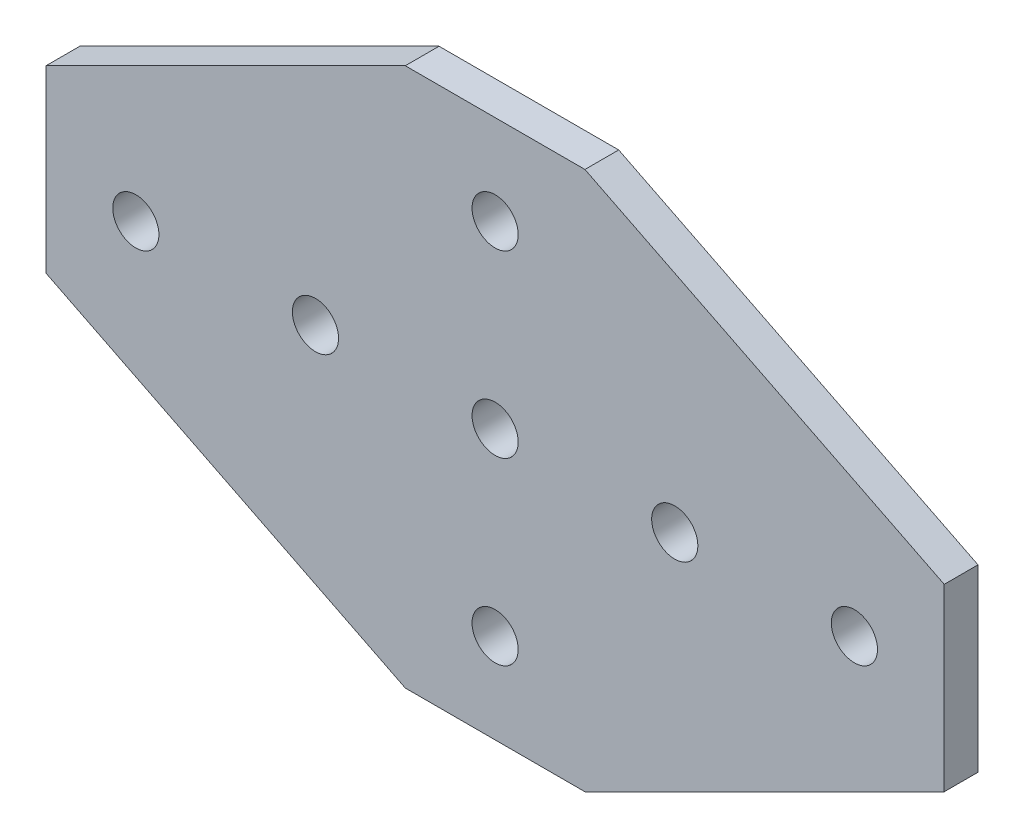
ISO-10303-21;
HEADER;
FILE_DESCRIPTION(('STEP AP214'),'2;1');
FILE_NAME('part.step','',(''),(''),'','','');
FILE_SCHEMA(('AUTOMOTIVE_DESIGN { 1 0 10303 214 1 1 1 1 }'));
ENDSEC;
DATA;
#1=APPLICATION_CONTEXT('core data for automotive mechanical design processes');
#2=APPLICATION_PROTOCOL_DEFINITION('international standard','automotive_design',2000,#1);
#3=PRODUCT_CONTEXT('',#1,'mechanical');
#4=PRODUCT('Part','Part','',(#3));
#5=PRODUCT_RELATED_PRODUCT_CATEGORY('part','',(#4));
#6=PRODUCT_DEFINITION_FORMATION('','',#4);
#7=PRODUCT_DEFINITION_CONTEXT('part definition',#1,'design');
#8=PRODUCT_DEFINITION('design','',#6,#7);
#9=PRODUCT_DEFINITION_SHAPE('','',#8);
#10=(LENGTH_UNIT() NAMED_UNIT(*) SI_UNIT(.MILLI.,.METRE.));
#11=(NAMED_UNIT(*) PLANE_ANGLE_UNIT() SI_UNIT($,.RADIAN.));
#12=(NAMED_UNIT(*) SI_UNIT($,.STERADIAN.) SOLID_ANGLE_UNIT());
#13=UNCERTAINTY_MEASURE_WITH_UNIT(LENGTH_MEASURE(1.E-05),#10,'distance_accuracy_value','');
#14=(GEOMETRIC_REPRESENTATION_CONTEXT(3) GLOBAL_UNCERTAINTY_ASSIGNED_CONTEXT((#13)) GLOBAL_UNIT_ASSIGNED_CONTEXT((#10,
#11,#12)) REPRESENTATION_CONTEXT('',''));
#15=CARTESIAN_POINT('',(0.,0.,0.));
#16=DIRECTION('',(0.,0.,1.));
#17=DIRECTION('',(1.,0.,0.));
#18=AXIS2_PLACEMENT_3D('',#15,#16,#17);
#19=CARTESIAN_POINT('',(0.,25.4,4.7752));
#20=DIRECTION('',(0.447213595499958,0.894427190999916,0.));
#21=DIRECTION('',(-0.894427190999916,0.447213595499958,0.));
#22=AXIS2_PLACEMENT_3D('',#19,#20,#21);
#23=PLANE('',#22);
#24=DIRECTION('',(0.894427190999916,-0.447213595499958,0.));
#25=VECTOR('',#24,1.);
#26=CARTESIAN_POINT('',(0.,25.4,0.));
#27=LINE('',#26,#25);
#28=CARTESIAN_POINT('',(0.,25.4,0.));
#29=VERTEX_POINT('',#28);
#30=CARTESIAN_POINT('',(50.8,0.,0.));
#31=VERTEX_POINT('',#30);
#32=EDGE_CURVE('E132',#29,#31,#27,.T.);
#33=ORIENTED_EDGE('',*,*,#32,.T.);
#34=DIRECTION('',(0.,0.,-1.));
#35=VECTOR('',#34,1.);
#36=CARTESIAN_POINT('',(50.8,0.,4.7752));
#37=LINE('',#36,#35);
#38=CARTESIAN_POINT('',(50.8,0.,4.7752));
#39=VERTEX_POINT('',#38);
#40=EDGE_CURVE('E160',#39,#31,#37,.T.);
#41=ORIENTED_EDGE('',*,*,#40,.F.);
#42=DIRECTION('',(0.894427190999916,-0.447213595499958,0.));
#43=VECTOR('',#42,1.);
#44=CARTESIAN_POINT('',(0.,25.4,4.7752));
#45=LINE('',#44,#43);
#46=CARTESIAN_POINT('',(0.,25.4,4.7752));
#47=VERTEX_POINT('',#46);
#48=EDGE_CURVE('E147',#47,#39,#45,.T.);
#49=ORIENTED_EDGE('',*,*,#48,.F.);
#50=DIRECTION('',(0.,0.,-1.));
#51=VECTOR('',#50,1.);
#52=CARTESIAN_POINT('',(0.,25.4,4.7752));
#53=LINE('',#52,#51);
#54=EDGE_CURVE('E128',#47,#29,#53,.T.);
#55=ORIENTED_EDGE('',*,*,#54,.T.);
#56=EDGE_LOOP('',(#33,#41,#49,#55));
#57=FACE_BOUND('',#56,.T.);
#58=ADVANCED_FACE('F33',(#57),#23,.F.);
#59=CARTESIAN_POINT('',(50.8,0.,4.7752));
#60=DIRECTION('',(0.,1.,0.));
#61=DIRECTION('',(-1.,0.,0.));
#62=AXIS2_PLACEMENT_3D('',#59,#60,#61);
#63=PLANE('',#62);
#64=DIRECTION('',(1.,0.,0.));
#65=VECTOR('',#64,1.);
#66=CARTESIAN_POINT('',(50.8,0.,0.));
#67=LINE('',#66,#65);
#68=CARTESIAN_POINT('',(76.2,0.,0.));
#69=VERTEX_POINT('',#68);
#70=EDGE_CURVE('E135',#31,#69,#67,.T.);
#71=ORIENTED_EDGE('',*,*,#70,.T.);
#72=DIRECTION('',(0.,0.,-1.));
#73=VECTOR('',#72,1.);
#74=CARTESIAN_POINT('',(76.2,0.,4.7752));
#75=LINE('',#74,#73);
#76=CARTESIAN_POINT('',(76.2,0.,4.7752));
#77=VERTEX_POINT('',#76);
#78=EDGE_CURVE('E157',#77,#69,#75,.T.);
#79=ORIENTED_EDGE('',*,*,#78,.F.);
#80=DIRECTION('',(1.,0.,0.));
#81=VECTOR('',#80,1.);
#82=CARTESIAN_POINT('',(50.8,0.,4.7752));
#83=LINE('',#82,#81);
#84=EDGE_CURVE('E94',#39,#77,#83,.T.);
#85=ORIENTED_EDGE('',*,*,#84,.F.);
#86=ORIENTED_EDGE('',*,*,#40,.T.);
#87=EDGE_LOOP('',(#71,#79,#85,#86));
#88=FACE_BOUND('',#87,.T.);
#89=ADVANCED_FACE('F200',(#88),#63,.F.);
#90=CARTESIAN_POINT('',(76.2,0.,4.7752));
#91=DIRECTION('',(-0.447213595499958,0.894427190999916,0.));
#92=DIRECTION('',(-0.894427190999916,-0.447213595499958,0.));
#93=AXIS2_PLACEMENT_3D('',#90,#91,#92);
#94=PLANE('',#93);
#95=DIRECTION('',(0.894427190999916,0.447213595499958,0.));
#96=VECTOR('',#95,1.);
#97=CARTESIAN_POINT('',(76.2,0.,0.));
#98=LINE('',#97,#96);
#99=CARTESIAN_POINT('',(127.,25.4,0.));
#100=VERTEX_POINT('',#99);
#101=EDGE_CURVE('E138',#69,#100,#98,.T.);
#102=ORIENTED_EDGE('',*,*,#101,.T.);
#103=DIRECTION('',(0.,0.,-1.));
#104=VECTOR('',#103,1.);
#105=CARTESIAN_POINT('',(127.,25.4,4.7752));
#106=LINE('',#105,#104);
#107=CARTESIAN_POINT('',(127.,25.4,4.7752));
#108=VERTEX_POINT('',#107);
#109=EDGE_CURVE('E154',#108,#100,#106,.T.);
#110=ORIENTED_EDGE('',*,*,#109,.F.);
#111=DIRECTION('',(0.894427190999916,0.447213595499958,0.));
#112=VECTOR('',#111,1.);
#113=CARTESIAN_POINT('',(76.2,0.,4.7752));
#114=LINE('',#113,#112);
#115=EDGE_CURVE('E333',#77,#108,#114,.T.);
#116=ORIENTED_EDGE('',*,*,#115,.F.);
#117=ORIENTED_EDGE('',*,*,#78,.T.);
#118=EDGE_LOOP('',(#102,#110,#116,#117));
#119=FACE_BOUND('',#118,.T.);
#120=ADVANCED_FACE('F206',(#119),#94,.F.);
#121=CARTESIAN_POINT('',(127.,25.4,4.7752));
#122=DIRECTION('',(-1.,0.,0.));
#123=DIRECTION('',(0.,0.,1.));
#124=AXIS2_PLACEMENT_3D('',#121,#122,#123);
#125=PLANE('',#124);
#126=DIRECTION('',(0.,1.,0.));
#127=VECTOR('',#126,1.);
#128=CARTESIAN_POINT('',(127.,25.4,0.));
#129=LINE('',#128,#127);
#130=CARTESIAN_POINT('',(127.,50.8,0.));
#131=VERTEX_POINT('',#130);
#132=EDGE_CURVE('E140',#100,#131,#129,.T.);
#133=ORIENTED_EDGE('',*,*,#132,.T.);
#134=DIRECTION('',(0.,0.,-1.));
#135=VECTOR('',#134,1.);
#136=CARTESIAN_POINT('',(127.,50.8,4.7752));
#137=LINE('',#136,#135);
#138=CARTESIAN_POINT('',(127.,50.8,4.7752));
#139=VERTEX_POINT('',#138);
#140=EDGE_CURVE('E151',#139,#131,#137,.T.);
#141=ORIENTED_EDGE('',*,*,#140,.F.);
#142=DIRECTION('',(0.,1.,0.));
#143=VECTOR('',#142,1.);
#144=CARTESIAN_POINT('',(127.,25.4,4.7752));
#145=LINE('',#144,#143);
#146=EDGE_CURVE('E329',#108,#139,#145,.T.);
#147=ORIENTED_EDGE('',*,*,#146,.F.);
#148=ORIENTED_EDGE('',*,*,#109,.T.);
#149=EDGE_LOOP('',(#133,#141,#147,#148));
#150=FACE_BOUND('',#149,.T.);
#151=ADVANCED_FACE('F288',(#150),#125,.F.);
#152=CARTESIAN_POINT('',(127.,50.8,4.7752));
#153=DIRECTION('',(-0.447213595499958,-0.894427190999916,0.));
#154=DIRECTION('',(0.894427190999916,-0.447213595499958,0.));
#155=AXIS2_PLACEMENT_3D('',#152,#153,#154);
#156=PLANE('',#155);
#157=DIRECTION('',(-0.894427190999916,0.447213595499958,0.));
#158=VECTOR('',#157,1.);
#159=CARTESIAN_POINT('',(127.,50.8,0.));
#160=LINE('',#159,#158);
#161=CARTESIAN_POINT('',(76.2,76.2,0.));
#162=VERTEX_POINT('',#161);
#163=EDGE_CURVE('E142',#131,#162,#160,.T.);
#164=ORIENTED_EDGE('',*,*,#163,.T.);
#165=DIRECTION('',(0.,0.,-1.));
#166=VECTOR('',#165,1.);
#167=CARTESIAN_POINT('',(76.2,76.2,4.7752));
#168=LINE('',#167,#166);
#169=CARTESIAN_POINT('',(76.2,76.2,4.7752));
#170=VERTEX_POINT('',#169);
#171=EDGE_CURVE('E123',#170,#162,#168,.T.);
#172=ORIENTED_EDGE('',*,*,#171,.F.);
#173=DIRECTION('',(-0.894427190999916,0.447213595499958,0.));
#174=VECTOR('',#173,1.);
#175=CARTESIAN_POINT('',(127.,50.8,4.7752));
#176=LINE('',#175,#174);
#177=EDGE_CURVE('E114',#139,#170,#176,.T.);
#178=ORIENTED_EDGE('',*,*,#177,.F.);
#179=ORIENTED_EDGE('',*,*,#140,.T.);
#180=EDGE_LOOP('',(#164,#172,#178,#179));
#181=FACE_BOUND('',#180,.T.);
#182=ADVANCED_FACE('F280',(#181),#156,.F.);
#183=CARTESIAN_POINT('',(76.2,76.2,4.7752));
#184=DIRECTION('',(0.,-1.,0.));
#185=DIRECTION('',(0.,0.,-1.));
#186=AXIS2_PLACEMENT_3D('',#183,#184,#185);
#187=PLANE('',#186);
#188=DIRECTION('',(-1.,0.,0.));
#189=VECTOR('',#188,1.);
#190=CARTESIAN_POINT('',(76.2,76.2,0.));
#191=LINE('',#190,#189);
#192=CARTESIAN_POINT('',(50.8,76.2,0.));
#193=VERTEX_POINT('',#192);
#194=EDGE_CURVE('E122',#162,#193,#191,.T.);
#195=ORIENTED_EDGE('',*,*,#194,.T.);
#196=DIRECTION('',(0.,0.,-1.));
#197=VECTOR('',#196,1.);
#198=CARTESIAN_POINT('',(50.8,76.2,4.7752));
#199=LINE('',#198,#197);
#200=CARTESIAN_POINT('',(50.8,76.2,4.7752));
#201=VERTEX_POINT('',#200);
#202=EDGE_CURVE('E119',#201,#193,#199,.T.);
#203=ORIENTED_EDGE('',*,*,#202,.F.);
#204=DIRECTION('',(-1.,0.,0.));
#205=VECTOR('',#204,1.);
#206=CARTESIAN_POINT('',(76.2,76.2,4.7752));
#207=LINE('',#206,#205);
#208=EDGE_CURVE('E107',#170,#201,#207,.T.);
#209=ORIENTED_EDGE('',*,*,#208,.F.);
#210=ORIENTED_EDGE('',*,*,#171,.T.);
#211=EDGE_LOOP('',(#195,#203,#209,#210));
#212=FACE_BOUND('',#211,.T.);
#213=ADVANCED_FACE('F120',(#212),#187,.F.);
#214=CARTESIAN_POINT('',(50.8,76.2,4.7752));
#215=DIRECTION('',(0.447213595499958,-0.894427190999916,0.));
#216=DIRECTION('',(0.894427190999916,0.447213595499958,0.));
#217=AXIS2_PLACEMENT_3D('',#214,#215,#216);
#218=PLANE('',#217);
#219=DIRECTION('',(-0.894427190999916,-0.447213595499958,0.));
#220=VECTOR('',#219,1.);
#221=CARTESIAN_POINT('',(50.8,76.2,0.));
#222=LINE('',#221,#220);
#223=CARTESIAN_POINT('',(0.,50.8,0.));
#224=VERTEX_POINT('',#223);
#225=EDGE_CURVE('E79',#193,#224,#222,.T.);
#226=ORIENTED_EDGE('',*,*,#225,.T.);
#227=DIRECTION('',(0.,0.,-1.));
#228=VECTOR('',#227,1.);
#229=CARTESIAN_POINT('',(0.,50.8,4.7752));
#230=LINE('',#229,#228);
#231=CARTESIAN_POINT('',(0.,50.8,4.7752));
#232=VERTEX_POINT('',#231);
#233=EDGE_CURVE('E124',#232,#224,#230,.T.);
#234=ORIENTED_EDGE('',*,*,#233,.F.);
#235=DIRECTION('',(-0.894427190999916,-0.447213595499958,0.));
#236=VECTOR('',#235,1.);
#237=CARTESIAN_POINT('',(50.8,76.2,4.7752));
#238=LINE('',#237,#236);
#239=EDGE_CURVE('E112',#201,#232,#238,.T.);
#240=ORIENTED_EDGE('',*,*,#239,.F.);
#241=ORIENTED_EDGE('',*,*,#202,.T.);
#242=EDGE_LOOP('',(#226,#234,#240,#241));
#243=FACE_BOUND('',#242,.T.);
#244=ADVANCED_FACE('F126',(#243),#218,.F.);
#245=CARTESIAN_POINT('',(0.,50.8,4.7752));
#246=DIRECTION('',(1.,0.,0.));
#247=DIRECTION('',(0.,1.,0.));
#248=AXIS2_PLACEMENT_3D('',#245,#246,#247);
#249=PLANE('',#248);
#250=DIRECTION('',(0.,-1.,0.));
#251=VECTOR('',#250,1.);
#252=CARTESIAN_POINT('',(0.,50.8,0.));
#253=LINE('',#252,#251);
#254=EDGE_CURVE('E85',#224,#29,#253,.T.);
#255=ORIENTED_EDGE('',*,*,#254,.T.);
#256=ORIENTED_EDGE('',*,*,#54,.F.);
#257=DIRECTION('',(0.,-1.,0.));
#258=VECTOR('',#257,1.);
#259=CARTESIAN_POINT('',(0.,50.8,4.7752));
#260=LINE('',#259,#258);
#261=EDGE_CURVE('E50',#232,#47,#260,.T.);
#262=ORIENTED_EDGE('',*,*,#261,.F.);
#263=ORIENTED_EDGE('',*,*,#233,.T.);
#264=EDGE_LOOP('',(#255,#256,#262,#263));
#265=FACE_BOUND('',#264,.T.);
#266=ADVANCED_FACE('F185',(#265),#249,.F.);
#267=CARTESIAN_POINT('',(127.,-38.1,4.7752));
#268=DIRECTION('',(0.,0.,1.));
#269=DIRECTION('',(1.,0.,0.));
#270=AXIS2_PLACEMENT_3D('',#267,#268,#269);
#271=PLANE('',#270);
#272=CARTESIAN_POINT('',(63.5,63.5,4.7752));
#273=DIRECTION('',(0.,0.,1.));
#274=DIRECTION('',(1.,0.,0.));
#275=AXIS2_PLACEMENT_3D('',#272,#273,#274);
#276=CIRCLE('',#275,3.26389999999999);
#277=CARTESIAN_POINT('',(66.7639,63.5,4.7752));
#278=VERTEX_POINT('',#277);
#279=EDGE_CURVE('E354',#278,#278,#276,.T.);
#280=ORIENTED_EDGE('',*,*,#279,.F.);
#281=EDGE_LOOP('',(#280));
#282=FACE_BOUND('',#281,.T.);
#283=CARTESIAN_POINT('',(63.5,12.7,4.7752));
#284=DIRECTION('',(0.,0.,1.));
#285=DIRECTION('',(1.,0.,0.));
#286=AXIS2_PLACEMENT_3D('',#283,#284,#285);
#287=CIRCLE('',#286,3.26389999999999);
#288=CARTESIAN_POINT('',(66.7639,12.7,4.7752));
#289=VERTEX_POINT('',#288);
#290=EDGE_CURVE('E351',#289,#289,#287,.T.);
#291=ORIENTED_EDGE('',*,*,#290,.F.);
#292=EDGE_LOOP('',(#291));
#293=FACE_BOUND('',#292,.T.);
#294=CARTESIAN_POINT('',(38.1,38.1,4.7752));
#295=DIRECTION('',(0.,0.,1.));
#296=DIRECTION('',(1.,0.,0.));
#297=AXIS2_PLACEMENT_3D('',#294,#295,#296);
#298=CIRCLE('',#297,3.2639);
#299=CARTESIAN_POINT('',(41.3639,38.1,4.7752));
#300=VERTEX_POINT('',#299);
#301=EDGE_CURVE('E342',#300,#300,#298,.T.);
#302=ORIENTED_EDGE('',*,*,#301,.F.);
#303=EDGE_LOOP('',(#302));
#304=FACE_BOUND('',#303,.T.);
#305=CARTESIAN_POINT('',(12.7,38.1,4.7752));
#306=DIRECTION('',(0.,0.,1.));
#307=DIRECTION('',(1.,0.,0.));
#308=AXIS2_PLACEMENT_3D('',#305,#306,#307);
#309=CIRCLE('',#308,3.2639);
#310=CARTESIAN_POINT('',(15.9639,38.1,4.7752));
#311=VERTEX_POINT('',#310);
#312=EDGE_CURVE('E339',#311,#311,#309,.T.);
#313=ORIENTED_EDGE('',*,*,#312,.F.);
#314=EDGE_LOOP('',(#313));
#315=FACE_BOUND('',#314,.T.);
#316=ORIENTED_EDGE('',*,*,#48,.T.);
#317=ORIENTED_EDGE('',*,*,#84,.T.);
#318=ORIENTED_EDGE('',*,*,#115,.T.);
#319=ORIENTED_EDGE('',*,*,#146,.T.);
#320=ORIENTED_EDGE('',*,*,#177,.T.);
#321=ORIENTED_EDGE('',*,*,#208,.T.);
#322=ORIENTED_EDGE('',*,*,#239,.T.);
#323=ORIENTED_EDGE('',*,*,#261,.T.);
#324=EDGE_LOOP('',(#316,#317,#318,#319,#320,#321,#322,#323));
#325=FACE_BOUND('',#324,.T.);
#326=CARTESIAN_POINT('',(63.5,38.1,4.7752));
#327=DIRECTION('',(0.,0.,1.));
#328=DIRECTION('',(1.,0.,0.));
#329=AXIS2_PLACEMENT_3D('',#326,#327,#328);
#330=CIRCLE('',#329,3.2639);
#331=CARTESIAN_POINT('',(66.7639,38.1,4.7752));
#332=VERTEX_POINT('',#331);
#333=EDGE_CURVE('E165',#332,#332,#330,.T.);
#334=ORIENTED_EDGE('',*,*,#333,.F.);
#335=EDGE_LOOP('',(#334));
#336=FACE_BOUND('',#335,.T.);
#337=CARTESIAN_POINT('',(88.9,38.1,4.7752));
#338=DIRECTION('',(0.,0.,1.));
#339=DIRECTION('',(1.,0.,0.));
#340=AXIS2_PLACEMENT_3D('',#337,#338,#339);
#341=CIRCLE('',#340,3.2639);
#342=CARTESIAN_POINT('',(92.1639,38.1,4.7752));
#343=VERTEX_POINT('',#342);
#344=EDGE_CURVE('E171',#343,#343,#341,.T.);
#345=ORIENTED_EDGE('',*,*,#344,.F.);
#346=EDGE_LOOP('',(#345));
#347=FACE_BOUND('',#346,.T.);
#348=CARTESIAN_POINT('',(114.3,38.1,4.7752));
#349=DIRECTION('',(0.,0.,1.));
#350=DIRECTION('',(1.,0.,0.));
#351=AXIS2_PLACEMENT_3D('',#348,#349,#350);
#352=CIRCLE('',#351,3.2639);
#353=CARTESIAN_POINT('',(117.5639,38.1,4.7752));
#354=VERTEX_POINT('',#353);
#355=EDGE_CURVE('E11',#354,#354,#352,.T.);
#356=ORIENTED_EDGE('',*,*,#355,.F.);
#357=EDGE_LOOP('',(#356));
#358=FACE_BOUND('',#357,.T.);
#359=ADVANCED_FACE('F109',(#282,#293,#304,#315,#325,#336,#347,#358),#271,.T.);
#360=CARTESIAN_POINT('',(127.,-38.1,0.));
#361=DIRECTION('',(0.,0.,1.));
#362=DIRECTION('',(1.,0.,0.));
#363=AXIS2_PLACEMENT_3D('',#360,#361,#362);
#364=PLANE('',#363);
#365=CARTESIAN_POINT('',(63.5,63.5,0.));
#366=DIRECTION('',(0.,0.,1.));
#367=DIRECTION('',(1.,0.,0.));
#368=AXIS2_PLACEMENT_3D('',#365,#366,#367);
#369=CIRCLE('',#368,3.26389999999999);
#370=CARTESIAN_POINT('',(66.7639,63.5,0.));
#371=VERTEX_POINT('',#370);
#372=EDGE_CURVE('E359',#371,#371,#369,.T.);
#373=ORIENTED_EDGE('',*,*,#372,.T.);
#374=EDGE_LOOP('',(#373));
#375=FACE_BOUND('',#374,.T.);
#376=CARTESIAN_POINT('',(63.5,12.7,0.));
#377=DIRECTION('',(0.,0.,1.));
#378=DIRECTION('',(1.,0.,0.));
#379=AXIS2_PLACEMENT_3D('',#376,#377,#378);
#380=CIRCLE('',#379,3.26389999999999);
#381=CARTESIAN_POINT('',(66.7639,12.7,0.));
#382=VERTEX_POINT('',#381);
#383=EDGE_CURVE('E350',#382,#382,#380,.T.);
#384=ORIENTED_EDGE('',*,*,#383,.T.);
#385=EDGE_LOOP('',(#384));
#386=FACE_BOUND('',#385,.T.);
#387=CARTESIAN_POINT('',(38.1,38.1,0.));
#388=DIRECTION('',(0.,0.,1.));
#389=DIRECTION('',(1.,0.,0.));
#390=AXIS2_PLACEMENT_3D('',#387,#388,#389);
#391=CIRCLE('',#390,3.2639);
#392=CARTESIAN_POINT('',(41.3639,38.1,0.));
#393=VERTEX_POINT('',#392);
#394=EDGE_CURVE('E347',#393,#393,#391,.T.);
#395=ORIENTED_EDGE('',*,*,#394,.T.);
#396=EDGE_LOOP('',(#395));
#397=FACE_BOUND('',#396,.T.);
#398=CARTESIAN_POINT('',(12.7,38.1,0.));
#399=DIRECTION('',(0.,0.,1.));
#400=DIRECTION('',(1.,0.,0.));
#401=AXIS2_PLACEMENT_3D('',#398,#399,#400);
#402=CIRCLE('',#401,3.2639);
#403=CARTESIAN_POINT('',(15.9639,38.1,0.));
#404=VERTEX_POINT('',#403);
#405=EDGE_CURVE('E136',#404,#404,#402,.T.);
#406=ORIENTED_EDGE('',*,*,#405,.T.);
#407=EDGE_LOOP('',(#406));
#408=FACE_BOUND('',#407,.T.);
#409=ORIENTED_EDGE('',*,*,#32,.F.);
#410=ORIENTED_EDGE('',*,*,#254,.F.);
#411=ORIENTED_EDGE('',*,*,#225,.F.);
#412=ORIENTED_EDGE('',*,*,#194,.F.);
#413=ORIENTED_EDGE('',*,*,#163,.F.);
#414=ORIENTED_EDGE('',*,*,#132,.F.);
#415=ORIENTED_EDGE('',*,*,#101,.F.);
#416=ORIENTED_EDGE('',*,*,#70,.F.);
#417=EDGE_LOOP('',(#409,#410,#411,#412,#413,#414,#415,#416));
#418=FACE_BOUND('',#417,.T.);
#419=CARTESIAN_POINT('',(63.5,38.1,0.));
#420=DIRECTION('',(0.,0.,1.));
#421=DIRECTION('',(1.,0.,0.));
#422=AXIS2_PLACEMENT_3D('',#419,#420,#421);
#423=CIRCLE('',#422,3.2639);
#424=CARTESIAN_POINT('',(66.7639,38.1,0.));
#425=VERTEX_POINT('',#424);
#426=EDGE_CURVE('E162',#425,#425,#423,.T.);
#427=ORIENTED_EDGE('',*,*,#426,.T.);
#428=EDGE_LOOP('',(#427));
#429=FACE_BOUND('',#428,.T.);
#430=CARTESIAN_POINT('',(88.9,38.1,0.));
#431=DIRECTION('',(0.,0.,1.));
#432=DIRECTION('',(1.,0.,0.));
#433=AXIS2_PLACEMENT_3D('',#430,#431,#432);
#434=CIRCLE('',#433,3.2639);
#435=CARTESIAN_POINT('',(92.1639,38.1,0.));
#436=VERTEX_POINT('',#435);
#437=EDGE_CURVE('E168',#436,#436,#434,.T.);
#438=ORIENTED_EDGE('',*,*,#437,.T.);
#439=EDGE_LOOP('',(#438));
#440=FACE_BOUND('',#439,.T.);
#441=CARTESIAN_POINT('',(114.3,38.1,0.));
#442=DIRECTION('',(0.,0.,1.));
#443=DIRECTION('',(1.,0.,0.));
#444=AXIS2_PLACEMENT_3D('',#441,#442,#443);
#445=CIRCLE('',#444,3.2639);
#446=CARTESIAN_POINT('',(117.5639,38.1,0.));
#447=VERTEX_POINT('',#446);
#448=EDGE_CURVE('E42',#447,#447,#445,.T.);
#449=ORIENTED_EDGE('',*,*,#448,.T.);
#450=EDGE_LOOP('',(#449));
#451=FACE_BOUND('',#450,.T.);
#452=ADVANCED_FACE('F176',(#375,#386,#397,#408,#418,#429,#440,#451),#364,.F.);
#453=CARTESIAN_POINT('',(12.7,38.1,0.));
#454=DIRECTION('',(0.,0.,1.));
#455=DIRECTION('',(1.,0.,0.));
#456=AXIS2_PLACEMENT_3D('',#453,#454,#455);
#457=CYLINDRICAL_SURFACE('',#456,3.2639);
#458=ORIENTED_EDGE('',*,*,#405,.F.);
#459=EDGE_LOOP('',(#458));
#460=FACE_BOUND('',#459,.T.);
#461=ORIENTED_EDGE('',*,*,#312,.T.);
#462=EDGE_LOOP('',(#461));
#463=FACE_BOUND('',#462,.T.);
#464=ADVANCED_FACE('F192',(#460,#463),#457,.F.);
#465=CARTESIAN_POINT('',(38.1,38.1,0.));
#466=DIRECTION('',(0.,0.,1.));
#467=DIRECTION('',(1.,0.,0.));
#468=AXIS2_PLACEMENT_3D('',#465,#466,#467);
#469=CYLINDRICAL_SURFACE('',#468,3.2639);
#470=ORIENTED_EDGE('',*,*,#394,.F.);
#471=EDGE_LOOP('',(#470));
#472=FACE_BOUND('',#471,.T.);
#473=ORIENTED_EDGE('',*,*,#301,.T.);
#474=EDGE_LOOP('',(#473));
#475=FACE_BOUND('',#474,.T.);
#476=ADVANCED_FACE('F212',(#472,#475),#469,.F.);
#477=CARTESIAN_POINT('',(63.5,38.1,0.));
#478=DIRECTION('',(0.,0.,1.));
#479=DIRECTION('',(1.,0.,0.));
#480=AXIS2_PLACEMENT_3D('',#477,#478,#479);
#481=CYLINDRICAL_SURFACE('',#480,3.2639);
#482=ORIENTED_EDGE('',*,*,#426,.F.);
#483=EDGE_LOOP('',(#482));
#484=FACE_BOUND('',#483,.T.);
#485=ORIENTED_EDGE('',*,*,#333,.T.);
#486=EDGE_LOOP('',(#485));
#487=FACE_BOUND('',#486,.T.);
#488=ADVANCED_FACE('F210',(#484,#487),#481,.F.);
#489=CARTESIAN_POINT('',(88.9,38.1,0.));
#490=DIRECTION('',(0.,0.,1.));
#491=DIRECTION('',(1.,0.,0.));
#492=AXIS2_PLACEMENT_3D('',#489,#490,#491);
#493=CYLINDRICAL_SURFACE('',#492,3.2639);
#494=ORIENTED_EDGE('',*,*,#437,.F.);
#495=EDGE_LOOP('',(#494));
#496=FACE_BOUND('',#495,.T.);
#497=ORIENTED_EDGE('',*,*,#344,.T.);
#498=EDGE_LOOP('',(#497));
#499=FACE_BOUND('',#498,.T.);
#500=ADVANCED_FACE('F181',(#496,#499),#493,.F.);
#501=CARTESIAN_POINT('',(114.3,38.1,0.));
#502=DIRECTION('',(0.,0.,1.));
#503=DIRECTION('',(1.,0.,0.));
#504=AXIS2_PLACEMENT_3D('',#501,#502,#503);
#505=CYLINDRICAL_SURFACE('',#504,3.2639);
#506=ORIENTED_EDGE('',*,*,#448,.F.);
#507=EDGE_LOOP('',(#506));
#508=FACE_BOUND('',#507,.T.);
#509=ORIENTED_EDGE('',*,*,#355,.T.);
#510=EDGE_LOOP('',(#509));
#511=FACE_BOUND('',#510,.T.);
#512=ADVANCED_FACE('F35',(#508,#511),#505,.F.);
#513=CARTESIAN_POINT('',(63.5,12.7,0.));
#514=DIRECTION('',(0.,0.,1.));
#515=DIRECTION('',(1.,0.,0.));
#516=AXIS2_PLACEMENT_3D('',#513,#514,#515);
#517=CYLINDRICAL_SURFACE('',#516,3.26389999999999);
#518=ORIENTED_EDGE('',*,*,#383,.F.);
#519=EDGE_LOOP('',(#518));
#520=FACE_BOUND('',#519,.T.);
#521=ORIENTED_EDGE('',*,*,#290,.T.);
#522=EDGE_LOOP('',(#521));
#523=FACE_BOUND('',#522,.T.);
#524=ADVANCED_FACE('F180',(#520,#523),#517,.F.);
#525=CARTESIAN_POINT('',(63.5,63.5,0.));
#526=DIRECTION('',(0.,0.,1.));
#527=DIRECTION('',(1.,0.,0.));
#528=AXIS2_PLACEMENT_3D('',#525,#526,#527);
#529=CYLINDRICAL_SURFACE('',#528,3.26389999999999);
#530=ORIENTED_EDGE('',*,*,#372,.F.);
#531=EDGE_LOOP('',(#530));
#532=FACE_BOUND('',#531,.T.);
#533=ORIENTED_EDGE('',*,*,#279,.T.);
#534=EDGE_LOOP('',(#533));
#535=FACE_BOUND('',#534,.T.);
#536=ADVANCED_FACE('F236',(#532,#535),#529,.F.);
#537=CLOSED_SHELL('',(#58,#89,#120,#151,#182,#213,#244,#266,#359,#452,#464,#476,#488,#500,#512,
#524,#536));
#538=MANIFOLD_SOLID_BREP('B2',#537);
#539=ADVANCED_BREP_SHAPE_REPRESENTATION('',(#18,#538),#14);
#540=SHAPE_DEFINITION_REPRESENTATION(#9,#539);
ENDSEC;
END-ISO-10303-21;
